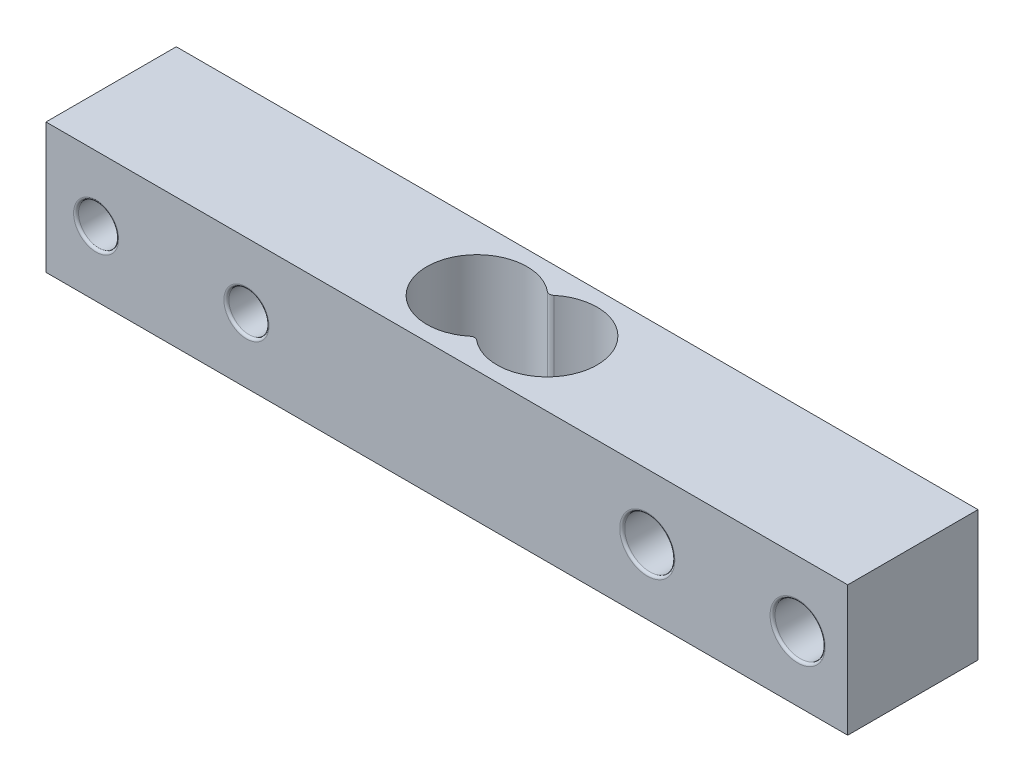
ISO-10303-21;
HEADER;
FILE_DESCRIPTION(('STEP AP214'),'2;1');
FILE_NAME('part.step','',(''),(''),'','','');
FILE_SCHEMA(('AUTOMOTIVE_DESIGN { 1 0 10303 214 1 1 1 1 }'));
ENDSEC;
DATA;
#1=APPLICATION_CONTEXT('core data for automotive mechanical design processes');
#2=APPLICATION_PROTOCOL_DEFINITION('international standard','automotive_design',2000,#1);
#3=PRODUCT_CONTEXT('',#1,'mechanical');
#4=PRODUCT('Part','Part','',(#3));
#5=PRODUCT_RELATED_PRODUCT_CATEGORY('part','',(#4));
#6=PRODUCT_DEFINITION_FORMATION('','',#4);
#7=PRODUCT_DEFINITION_CONTEXT('part definition',#1,'design');
#8=PRODUCT_DEFINITION('design','',#6,#7);
#9=PRODUCT_DEFINITION_SHAPE('','',#8);
#10=(LENGTH_UNIT() NAMED_UNIT(*) SI_UNIT(.MILLI.,.METRE.));
#11=(NAMED_UNIT(*) PLANE_ANGLE_UNIT() SI_UNIT($,.RADIAN.));
#12=(NAMED_UNIT(*) SI_UNIT($,.STERADIAN.) SOLID_ANGLE_UNIT());
#13=UNCERTAINTY_MEASURE_WITH_UNIT(LENGTH_MEASURE(1.E-05),#10,'distance_accuracy_value','');
#14=(GEOMETRIC_REPRESENTATION_CONTEXT(3) GLOBAL_UNCERTAINTY_ASSIGNED_CONTEXT((#13)) GLOBAL_UNIT_ASSIGNED_CONTEXT((#10,
#11,#12)) REPRESENTATION_CONTEXT('',''));
#15=CARTESIAN_POINT('',(0.,0.,0.));
#16=DIRECTION('',(0.,0.,1.));
#17=DIRECTION('',(1.,0.,0.));
#18=AXIS2_PLACEMENT_3D('',#15,#16,#17);
#19=CARTESIAN_POINT('',(52.0209096982276,13.,-13.5538600905865));
#20=DIRECTION('',(1.,0.,0.));
#21=DIRECTION('',(0.,0.,-1.));
#22=AXIS2_PLACEMENT_3D('',#19,#20,#21);
#23=PLANE('',#22);
#24=DIRECTION('',(0.,0.,1.));
#25=VECTOR('',#24,1.);
#26=CARTESIAN_POINT('',(52.0209096982276,0.,-13.5538600905865));
#27=LINE('',#26,#25);
#28=CARTESIAN_POINT('',(52.0209096982276,0.,-13.5538600905865));
#29=VERTEX_POINT('',#28);
#30=CARTESIAN_POINT('',(52.0209096982276,0.,-0.553860090586464));
#31=VERTEX_POINT('',#30);
#32=EDGE_CURVE('E133',#29,#31,#27,.T.);
#33=ORIENTED_EDGE('',*,*,#32,.F.);
#34=DIRECTION('',(0.,-1.,0.));
#35=VECTOR('',#34,1.);
#36=CARTESIAN_POINT('',(52.0209096982276,13.,-13.5538600905865));
#37=LINE('',#36,#35);
#38=CARTESIAN_POINT('',(52.0209096982276,13.,-13.5538600905865));
#39=VERTEX_POINT('',#38);
#40=EDGE_CURVE('E121',#39,#29,#37,.T.);
#41=ORIENTED_EDGE('',*,*,#40,.F.);
#42=DIRECTION('',(0.,0.,1.));
#43=VECTOR('',#42,1.);
#44=CARTESIAN_POINT('',(52.0209096982276,13.,-13.5538600905865));
#45=LINE('',#44,#43);
#46=CARTESIAN_POINT('',(52.0209096982276,13.,-0.553860090586464));
#47=VERTEX_POINT('',#46);
#48=EDGE_CURVE('E116',#39,#47,#45,.T.);
#49=ORIENTED_EDGE('',*,*,#48,.T.);
#50=DIRECTION('',(0.,-1.,0.));
#51=VECTOR('',#50,1.);
#52=CARTESIAN_POINT('',(52.0209096982276,13.,-0.553860090586464));
#53=LINE('',#52,#51);
#54=EDGE_CURVE('E98',#47,#31,#53,.T.);
#55=ORIENTED_EDGE('',*,*,#54,.T.);
#56=EDGE_LOOP('',(#33,#41,#49,#55));
#57=FACE_BOUND('',#56,.T.);
#58=ADVANCED_FACE('F34',(#57),#23,.T.);
#59=CARTESIAN_POINT('',(-27.9790903017724,13.,-13.5538600905865));
#60=DIRECTION('',(0.,0.,-1.));
#61=DIRECTION('',(-1.,0.,0.));
#62=AXIS2_PLACEMENT_3D('',#59,#60,#61);
#63=PLANE('',#62);
#64=CARTESIAN_POINT('',(-7.97909030177238,6.5,-13.5538600905865));
#65=DIRECTION('',(0.,0.,-1.));
#66=DIRECTION('',(-1.,0.,0.));
#67=AXIS2_PLACEMENT_3D('',#64,#65,#66);
#68=CIRCLE('',#67,2.24999999999999);
#69=CARTESIAN_POINT('',(-10.2290903017724,6.5,-13.5538600905865));
#70=VERTEX_POINT('',#69);
#71=EDGE_CURVE('E151',#70,#70,#68,.F.);
#72=ORIENTED_EDGE('',*,*,#71,.T.);
#73=EDGE_LOOP('',(#72));
#74=FACE_BOUND('',#73,.T.);
#75=CARTESIAN_POINT('',(32.0209096982276,6.5,-13.5538600905865));
#76=DIRECTION('',(0.,0.,-1.));
#77=DIRECTION('',(-1.,0.,0.));
#78=AXIS2_PLACEMENT_3D('',#75,#76,#77);
#79=CIRCLE('',#78,2.74999999999999);
#80=CARTESIAN_POINT('',(29.2709096982276,6.5,-13.5538600905865));
#81=VERTEX_POINT('',#80);
#82=EDGE_CURVE('E148',#81,#81,#79,.F.);
#83=ORIENTED_EDGE('',*,*,#82,.T.);
#84=EDGE_LOOP('',(#83));
#85=FACE_BOUND('',#84,.T.);
#86=CARTESIAN_POINT('',(47.0209096982276,6.5,-13.5538600905865));
#87=DIRECTION('',(0.,0.,-1.));
#88=DIRECTION('',(-1.,0.,0.));
#89=AXIS2_PLACEMENT_3D('',#86,#87,#88);
#90=CIRCLE('',#89,2.74999999999999);
#91=CARTESIAN_POINT('',(44.2709096982276,6.5,-13.5538600905865));
#92=VERTEX_POINT('',#91);
#93=EDGE_CURVE('E145',#92,#92,#90,.F.);
#94=ORIENTED_EDGE('',*,*,#93,.T.);
#95=EDGE_LOOP('',(#94));
#96=FACE_BOUND('',#95,.T.);
#97=CARTESIAN_POINT('',(-22.9790903017724,6.5,-13.5538600905865));
#98=DIRECTION('',(0.,0.,-1.));
#99=DIRECTION('',(-1.,0.,0.));
#100=AXIS2_PLACEMENT_3D('',#97,#98,#99);
#101=CIRCLE('',#100,2.24999999999998);
#102=CARTESIAN_POINT('',(-25.2290903017724,6.5,-13.5538600905865));
#103=VERTEX_POINT('',#102);
#104=EDGE_CURVE('E139',#103,#103,#101,.F.);
#105=ORIENTED_EDGE('',*,*,#104,.T.);
#106=EDGE_LOOP('',(#105));
#107=FACE_BOUND('',#106,.T.);
#108=DIRECTION('',(1.,0.,0.));
#109=VECTOR('',#108,1.);
#110=CARTESIAN_POINT('',(-27.9790903017724,0.,-13.5538600905865));
#111=LINE('',#110,#109);
#112=CARTESIAN_POINT('',(-27.9790903017724,0.,-13.5538600905865));
#113=VERTEX_POINT('',#112);
#114=EDGE_CURVE('E122',#113,#29,#111,.T.);
#115=ORIENTED_EDGE('',*,*,#114,.F.);
#116=DIRECTION('',(0.,-1.,0.));
#117=VECTOR('',#116,1.);
#118=CARTESIAN_POINT('',(-27.9790903017724,13.,-13.5538600905865));
#119=LINE('',#118,#117);
#120=CARTESIAN_POINT('',(-27.9790903017724,13.,-13.5538600905865));
#121=VERTEX_POINT('',#120);
#122=EDGE_CURVE('E140',#121,#113,#119,.T.);
#123=ORIENTED_EDGE('',*,*,#122,.F.);
#124=DIRECTION('',(1.,0.,0.));
#125=VECTOR('',#124,1.);
#126=CARTESIAN_POINT('',(-27.9790903017724,13.,-13.5538600905865));
#127=LINE('',#126,#125);
#128=EDGE_CURVE('E109',#121,#39,#127,.T.);
#129=ORIENTED_EDGE('',*,*,#128,.T.);
#130=ORIENTED_EDGE('',*,*,#40,.T.);
#131=EDGE_LOOP('',(#115,#123,#129,#130));
#132=FACE_BOUND('',#131,.T.);
#133=ADVANCED_FACE('F235',(#74,#85,#96,#107,#132),#63,.T.);
#134=CARTESIAN_POINT('',(-27.9790903017724,13.,-0.553860090586464));
#135=DIRECTION('',(-1.,0.,0.));
#136=DIRECTION('',(0.,0.,1.));
#137=AXIS2_PLACEMENT_3D('',#134,#135,#136);
#138=PLANE('',#137);
#139=DIRECTION('',(0.,0.,-1.));
#140=VECTOR('',#139,1.);
#141=CARTESIAN_POINT('',(-27.9790903017724,0.,-0.553860090586464));
#142=LINE('',#141,#140);
#143=CARTESIAN_POINT('',(-27.9790903017724,0.,-0.553860090586464));
#144=VERTEX_POINT('',#143);
#145=EDGE_CURVE('E125',#144,#113,#142,.T.);
#146=ORIENTED_EDGE('',*,*,#145,.F.);
#147=DIRECTION('',(0.,-1.,0.));
#148=VECTOR('',#147,1.);
#149=CARTESIAN_POINT('',(-27.9790903017724,13.,-0.553860090586464));
#150=LINE('',#149,#148);
#151=CARTESIAN_POINT('',(-27.9790903017724,13.,-0.553860090586464));
#152=VERTEX_POINT('',#151);
#153=EDGE_CURVE('E108',#152,#144,#150,.T.);
#154=ORIENTED_EDGE('',*,*,#153,.F.);
#155=DIRECTION('',(0.,0.,-1.));
#156=VECTOR('',#155,1.);
#157=CARTESIAN_POINT('',(-27.9790903017724,13.,-0.553860090586464));
#158=LINE('',#157,#156);
#159=EDGE_CURVE('E119',#152,#121,#158,.T.);
#160=ORIENTED_EDGE('',*,*,#159,.T.);
#161=ORIENTED_EDGE('',*,*,#122,.T.);
#162=EDGE_LOOP('',(#146,#154,#160,#161));
#163=FACE_BOUND('',#162,.T.);
#164=ADVANCED_FACE('F240',(#163),#138,.T.);
#165=CARTESIAN_POINT('',(52.0209096982276,13.,-0.553860090586464));
#166=DIRECTION('',(0.,0.,1.));
#167=DIRECTION('',(1.,0.,0.));
#168=AXIS2_PLACEMENT_3D('',#165,#166,#167);
#169=PLANE('',#168);
#170=CARTESIAN_POINT('',(-7.97909030177238,6.5,-0.553860090586464));
#171=DIRECTION('',(0.,0.,1.));
#172=DIRECTION('',(1.,0.,0.));
#173=AXIS2_PLACEMENT_3D('',#170,#171,#172);
#174=CIRCLE('',#173,2.24999999999999);
#175=CARTESIAN_POINT('',(-5.72909030177239,6.5,-0.553860090586464));
#176=VERTEX_POINT('',#175);
#177=EDGE_CURVE('E169',#176,#176,#174,.F.);
#178=ORIENTED_EDGE('',*,*,#177,.T.);
#179=EDGE_LOOP('',(#178));
#180=FACE_BOUND('',#179,.T.);
#181=CARTESIAN_POINT('',(32.0209096982276,6.5,-0.553860090586464));
#182=DIRECTION('',(0.,0.,1.));
#183=DIRECTION('',(1.,0.,0.));
#184=AXIS2_PLACEMENT_3D('',#181,#182,#183);
#185=CIRCLE('',#184,2.74999999999999);
#186=CARTESIAN_POINT('',(34.7709096982276,6.5,-0.553860090586464));
#187=VERTEX_POINT('',#186);
#188=EDGE_CURVE('E166',#187,#187,#185,.F.);
#189=ORIENTED_EDGE('',*,*,#188,.T.);
#190=EDGE_LOOP('',(#189));
#191=FACE_BOUND('',#190,.T.);
#192=CARTESIAN_POINT('',(-22.9790903017724,6.5,-0.553860090586464));
#193=DIRECTION('',(0.,0.,1.));
#194=DIRECTION('',(1.,0.,0.));
#195=AXIS2_PLACEMENT_3D('',#192,#193,#194);
#196=CIRCLE('',#195,2.24999999999998);
#197=CARTESIAN_POINT('',(-20.7290903017724,6.5,-0.553860090586464));
#198=VERTEX_POINT('',#197);
#199=EDGE_CURVE('E163',#198,#198,#196,.F.);
#200=ORIENTED_EDGE('',*,*,#199,.T.);
#201=EDGE_LOOP('',(#200));
#202=FACE_BOUND('',#201,.T.);
#203=CARTESIAN_POINT('',(47.0209096982276,6.5,-0.553860090586464));
#204=DIRECTION('',(0.,0.,1.));
#205=DIRECTION('',(1.,0.,0.));
#206=AXIS2_PLACEMENT_3D('',#203,#204,#205);
#207=CIRCLE('',#206,2.74999999999999);
#208=CARTESIAN_POINT('',(49.7709096982276,6.5,-0.553860090586464));
#209=VERTEX_POINT('',#208);
#210=EDGE_CURVE('E160',#209,#209,#207,.F.);
#211=ORIENTED_EDGE('',*,*,#210,.T.);
#212=EDGE_LOOP('',(#211));
#213=FACE_BOUND('',#212,.T.);
#214=DIRECTION('',(-1.,0.,0.));
#215=VECTOR('',#214,1.);
#216=CARTESIAN_POINT('',(52.0209096982276,0.,-0.553860090586464));
#217=LINE('',#216,#215);
#218=EDGE_CURVE('E103',#31,#144,#217,.T.);
#219=ORIENTED_EDGE('',*,*,#218,.F.);
#220=ORIENTED_EDGE('',*,*,#54,.F.);
#221=DIRECTION('',(-1.,0.,0.));
#222=VECTOR('',#221,1.);
#223=CARTESIAN_POINT('',(52.0209096982276,13.,-0.553860090586464));
#224=LINE('',#223,#222);
#225=EDGE_CURVE('E101',#47,#152,#224,.T.);
#226=ORIENTED_EDGE('',*,*,#225,.T.);
#227=ORIENTED_EDGE('',*,*,#153,.T.);
#228=EDGE_LOOP('',(#219,#220,#226,#227));
#229=FACE_BOUND('',#228,.T.);
#230=ADVANCED_FACE('F100',(#180,#191,#202,#213,#229),#169,.T.);
#231=CARTESIAN_POINT('',(0.,13.,0.));
#232=DIRECTION('',(0.,-1.,0.));
#233=DIRECTION('',(0.,0.,-1.));
#234=AXIS2_PLACEMENT_3D('',#231,#232,#233);
#235=PLANE('',#234);
#236=CARTESIAN_POINT('',(8.52090969822762,13.,-7.05386009058646));
#237=DIRECTION('',(0.,1.,0.));
#238=DIRECTION('',(0.,0.,1.));
#239=AXIS2_PLACEMENT_3D('',#236,#237,#238);
#240=CIRCLE('',#239,4.99999999999999);
#241=CARTESIAN_POINT('',(11.7027278800458,13.,-10.9108061697858));
#242=VERTEX_POINT('',#241);
#243=CARTESIAN_POINT('',(11.7027278800458,13.,-3.19691401138712));
#244=VERTEX_POINT('',#243);
#245=EDGE_CURVE('E212',#242,#244,#240,.T.);
#246=ORIENTED_EDGE('',*,*,#245,.F.);
#247=CARTESIAN_POINT('',(12.0209096982276,13.,-11.2965007777057));
#248=DIRECTION('',(0.,-1.,0.));
#249=DIRECTION('',(0.,0.,-1.));
#250=AXIS2_PLACEMENT_3D('',#247,#248,#249);
#251=CIRCLE('',#250,0.5);
#252=CARTESIAN_POINT('',(12.3390915164094,13.,-10.9108061697858));
#253=VERTEX_POINT('',#252);
#254=EDGE_CURVE('E198',#242,#253,#251,.F.);
#255=ORIENTED_EDGE('',*,*,#254,.T.);
#256=CARTESIAN_POINT('',(15.5209096982276,13.,-7.05386009058646));
#257=DIRECTION('',(0.,-1.,0.));
#258=DIRECTION('',(0.,0.,-1.));
#259=AXIS2_PLACEMENT_3D('',#256,#257,#258);
#260=CIRCLE('',#259,4.99999999999999);
#261=CARTESIAN_POINT('',(12.3390915164094,13.,-3.19691401138712));
#262=VERTEX_POINT('',#261);
#263=EDGE_CURVE('E205',#253,#262,#260,.T.);
#264=ORIENTED_EDGE('',*,*,#263,.T.);
#265=CARTESIAN_POINT('',(12.0209096982276,13.,-2.81121940346718));
#266=DIRECTION('',(0.,-1.,0.));
#267=DIRECTION('',(0.,0.,-1.));
#268=AXIS2_PLACEMENT_3D('',#265,#266,#267);
#269=CIRCLE('',#268,0.5);
#270=EDGE_CURVE('E196',#262,#244,#269,.F.);
#271=ORIENTED_EDGE('',*,*,#270,.T.);
#272=EDGE_LOOP('',(#246,#255,#264,#271));
#273=FACE_BOUND('',#272,.T.);
#274=ORIENTED_EDGE('',*,*,#48,.F.);
#275=ORIENTED_EDGE('',*,*,#128,.F.);
#276=ORIENTED_EDGE('',*,*,#159,.F.);
#277=ORIENTED_EDGE('',*,*,#225,.F.);
#278=EDGE_LOOP('',(#274,#275,#276,#277));
#279=FACE_BOUND('',#278,.T.);
#280=ADVANCED_FACE('F114',(#273,#279),#235,.F.);
#281=CARTESIAN_POINT('',(0.,0.,0.));
#282=DIRECTION('',(0.,-1.,0.));
#283=DIRECTION('',(0.,0.,-1.));
#284=AXIS2_PLACEMENT_3D('',#281,#282,#283);
#285=PLANE('',#284);
#286=CARTESIAN_POINT('',(15.5209096982276,0.,-7.05386009058646));
#287=DIRECTION('',(0.,-1.,0.));
#288=DIRECTION('',(0.,0.,-1.));
#289=AXIS2_PLACEMENT_3D('',#286,#287,#288);
#290=CIRCLE('',#289,4.99999999999999);
#291=CARTESIAN_POINT('',(12.3390915164094,0.,-10.9108061697858));
#292=VERTEX_POINT('',#291);
#293=CARTESIAN_POINT('',(12.3390915164094,0.,-3.19691401138712));
#294=VERTEX_POINT('',#293);
#295=EDGE_CURVE('E206',#292,#294,#290,.T.);
#296=ORIENTED_EDGE('',*,*,#295,.F.);
#297=CARTESIAN_POINT('',(12.0209096982276,0.,-11.2965007777057));
#298=DIRECTION('',(0.,-1.,0.));
#299=DIRECTION('',(0.,0.,-1.));
#300=AXIS2_PLACEMENT_3D('',#297,#298,#299);
#301=CIRCLE('',#300,0.5);
#302=CARTESIAN_POINT('',(11.7027278800458,0.,-10.9108061697858));
#303=VERTEX_POINT('',#302);
#304=EDGE_CURVE('E11',#292,#303,#301,.T.);
#305=ORIENTED_EDGE('',*,*,#304,.T.);
#306=CARTESIAN_POINT('',(8.52090969822762,0.,-7.05386009058646));
#307=DIRECTION('',(0.,1.,0.));
#308=DIRECTION('',(0.,0.,1.));
#309=AXIS2_PLACEMENT_3D('',#306,#307,#308);
#310=CIRCLE('',#309,4.99999999999999);
#311=CARTESIAN_POINT('',(11.7027278800458,0.,-3.19691401138712));
#312=VERTEX_POINT('',#311);
#313=EDGE_CURVE('E128',#303,#312,#310,.T.);
#314=ORIENTED_EDGE('',*,*,#313,.T.);
#315=CARTESIAN_POINT('',(12.0209096982276,0.,-2.81121940346718));
#316=DIRECTION('',(0.,-1.,0.));
#317=DIRECTION('',(0.,0.,-1.));
#318=AXIS2_PLACEMENT_3D('',#315,#316,#317);
#319=CIRCLE('',#318,0.5);
#320=EDGE_CURVE('E42',#312,#294,#319,.T.);
#321=ORIENTED_EDGE('',*,*,#320,.T.);
#322=EDGE_LOOP('',(#296,#305,#314,#321));
#323=FACE_BOUND('',#322,.T.);
#324=ORIENTED_EDGE('',*,*,#32,.T.);
#325=ORIENTED_EDGE('',*,*,#218,.T.);
#326=ORIENTED_EDGE('',*,*,#145,.T.);
#327=ORIENTED_EDGE('',*,*,#114,.T.);
#328=EDGE_LOOP('',(#324,#325,#326,#327));
#329=FACE_BOUND('',#328,.T.);
#330=ADVANCED_FACE('F219',(#323,#329),#285,.T.);
#331=CARTESIAN_POINT('',(47.0209096982276,6.5,-0.553860090586464));
#332=DIRECTION('',(0.,0.,1.));
#333=DIRECTION('',(1.,0.,0.));
#334=AXIS2_PLACEMENT_3D('',#331,#332,#333);
#335=CYLINDRICAL_SURFACE('',#334,2.49999999999999);
#336=CARTESIAN_POINT('',(47.0209096982276,6.5,-13.3038600905865));
#337=DIRECTION('',(0.,0.,-1.));
#338=DIRECTION('',(-1.,0.,0.));
#339=AXIS2_PLACEMENT_3D('',#336,#337,#338);
#340=CIRCLE('',#339,2.49999999999999);
#341=CARTESIAN_POINT('',(44.5209096982276,6.5,-13.3038600905865));
#342=VERTEX_POINT('',#341);
#343=EDGE_CURVE('E181',#342,#342,#340,.T.);
#344=ORIENTED_EDGE('',*,*,#343,.T.);
#345=EDGE_LOOP('',(#344));
#346=FACE_BOUND('',#345,.T.);
#347=CARTESIAN_POINT('',(47.0209096982276,6.5,-0.803860090586464));
#348=DIRECTION('',(0.,0.,1.));
#349=DIRECTION('',(1.,0.,0.));
#350=AXIS2_PLACEMENT_3D('',#347,#348,#349);
#351=CIRCLE('',#350,2.49999999999999);
#352=CARTESIAN_POINT('',(49.5209096982276,6.5,-0.803860090586464));
#353=VERTEX_POINT('',#352);
#354=EDGE_CURVE('E178',#353,#353,#351,.T.);
#355=ORIENTED_EDGE('',*,*,#354,.T.);
#356=EDGE_LOOP('',(#355));
#357=FACE_BOUND('',#356,.T.);
#358=ADVANCED_FACE('F278',(#346,#357),#335,.F.);
#359=CARTESIAN_POINT('',(32.0209096982276,6.5,-0.553860090586464));
#360=DIRECTION('',(0.,0.,1.));
#361=DIRECTION('',(1.,0.,0.));
#362=AXIS2_PLACEMENT_3D('',#359,#360,#361);
#363=CYLINDRICAL_SURFACE('',#362,2.49999999999999);
#364=CARTESIAN_POINT('',(32.0209096982276,6.5,-13.3038600905865));
#365=DIRECTION('',(0.,0.,-1.));
#366=DIRECTION('',(-1.,0.,0.));
#367=AXIS2_PLACEMENT_3D('',#364,#365,#366);
#368=CIRCLE('',#367,2.49999999999999);
#369=CARTESIAN_POINT('',(29.5209096982276,6.5,-13.3038600905865));
#370=VERTEX_POINT('',#369);
#371=EDGE_CURVE('E175',#370,#370,#368,.T.);
#372=ORIENTED_EDGE('',*,*,#371,.T.);
#373=EDGE_LOOP('',(#372));
#374=FACE_BOUND('',#373,.T.);
#375=CARTESIAN_POINT('',(32.0209096982276,6.5,-0.803860090586464));
#376=DIRECTION('',(0.,0.,1.));
#377=DIRECTION('',(1.,0.,0.));
#378=AXIS2_PLACEMENT_3D('',#375,#376,#377);
#379=CIRCLE('',#378,2.49999999999999);
#380=CARTESIAN_POINT('',(34.5209096982276,6.5,-0.803860090586464));
#381=VERTEX_POINT('',#380);
#382=EDGE_CURVE('E172',#381,#381,#379,.T.);
#383=ORIENTED_EDGE('',*,*,#382,.T.);
#384=EDGE_LOOP('',(#383));
#385=FACE_BOUND('',#384,.T.);
#386=ADVANCED_FACE('F280',(#374,#385),#363,.F.);
#387=CARTESIAN_POINT('',(-7.97909030177238,6.5,-0.553860090586464));
#388=DIRECTION('',(0.,0.,1.));
#389=DIRECTION('',(1.,0.,0.));
#390=AXIS2_PLACEMENT_3D('',#387,#388,#389);
#391=CYLINDRICAL_SURFACE('',#390,1.99999999999999);
#392=CARTESIAN_POINT('',(-7.97909030177238,6.5,-13.3038600905865));
#393=DIRECTION('',(0.,0.,-1.));
#394=DIRECTION('',(-1.,0.,0.));
#395=AXIS2_PLACEMENT_3D('',#392,#393,#394);
#396=CIRCLE('',#395,1.99999999999999);
#397=CARTESIAN_POINT('',(-9.97909030177237,6.5,-13.3038600905865));
#398=VERTEX_POINT('',#397);
#399=EDGE_CURVE('E157',#398,#398,#396,.T.);
#400=ORIENTED_EDGE('',*,*,#399,.T.);
#401=EDGE_LOOP('',(#400));
#402=FACE_BOUND('',#401,.T.);
#403=CARTESIAN_POINT('',(-7.97909030177238,6.5,-0.803860090586464));
#404=DIRECTION('',(0.,0.,1.));
#405=DIRECTION('',(1.,0.,0.));
#406=AXIS2_PLACEMENT_3D('',#403,#404,#405);
#407=CIRCLE('',#406,1.99999999999999);
#408=CARTESIAN_POINT('',(-5.97909030177239,6.5,-0.803860090586464));
#409=VERTEX_POINT('',#408);
#410=EDGE_CURVE('E154',#409,#409,#407,.T.);
#411=ORIENTED_EDGE('',*,*,#410,.T.);
#412=EDGE_LOOP('',(#411));
#413=FACE_BOUND('',#412,.T.);
#414=ADVANCED_FACE('F287',(#402,#413),#391,.F.);
#415=CARTESIAN_POINT('',(-22.9790903017724,6.5,-13.5538600905865));
#416=DIRECTION('',(0.,0.,-1.));
#417=DIRECTION('',(-1.,0.,0.));
#418=AXIS2_PLACEMENT_3D('',#415,#416,#417);
#419=CYLINDRICAL_SURFACE('',#418,1.99999999999998);
#420=CARTESIAN_POINT('',(-22.9790903017724,6.5,-0.803860090586464));
#421=DIRECTION('',(0.,0.,1.));
#422=DIRECTION('',(1.,0.,0.));
#423=AXIS2_PLACEMENT_3D('',#420,#421,#422);
#424=CIRCLE('',#423,1.99999999999998);
#425=CARTESIAN_POINT('',(-20.9790903017724,6.5,-0.803860090586464));
#426=VERTEX_POINT('',#425);
#427=EDGE_CURVE('E187',#426,#426,#424,.T.);
#428=ORIENTED_EDGE('',*,*,#427,.T.);
#429=EDGE_LOOP('',(#428));
#430=FACE_BOUND('',#429,.T.);
#431=CARTESIAN_POINT('',(-22.9790903017724,6.5,-13.3038600905865));
#432=DIRECTION('',(0.,0.,-1.));
#433=DIRECTION('',(-1.,0.,0.));
#434=AXIS2_PLACEMENT_3D('',#431,#432,#433);
#435=CIRCLE('',#434,1.99999999999998);
#436=CARTESIAN_POINT('',(-24.9790903017724,6.5,-13.3038600905865));
#437=VERTEX_POINT('',#436);
#438=EDGE_CURVE('E184',#437,#437,#435,.T.);
#439=ORIENTED_EDGE('',*,*,#438,.T.);
#440=EDGE_LOOP('',(#439));
#441=FACE_BOUND('',#440,.T.);
#442=ADVANCED_FACE('F319',(#430,#441),#419,.F.);
#443=CARTESIAN_POINT('',(8.52090969822762,13.,-7.05386009058646));
#444=DIRECTION('',(0.,1.,0.));
#445=DIRECTION('',(0.,0.,1.));
#446=AXIS2_PLACEMENT_3D('',#443,#444,#445);
#447=CYLINDRICAL_SURFACE('',#446,4.99999999999999);
#448=ORIENTED_EDGE('',*,*,#313,.F.);
#449=DIRECTION('',(0.,1.,0.));
#450=VECTOR('',#449,1.);
#451=CARTESIAN_POINT('',(11.7027278800458,13.,-10.9108061697858));
#452=LINE('',#451,#450);
#453=EDGE_CURVE('E193',#303,#242,#452,.T.);
#454=ORIENTED_EDGE('',*,*,#453,.T.);
#455=ORIENTED_EDGE('',*,*,#245,.T.);
#456=DIRECTION('',(0.,1.,0.));
#457=VECTOR('',#456,1.);
#458=CARTESIAN_POINT('',(11.7027278800458,13.,-3.19691401138712));
#459=LINE('',#458,#457);
#460=EDGE_CURVE('E190',#244,#312,#459,.F.);
#461=ORIENTED_EDGE('',*,*,#460,.T.);
#462=EDGE_LOOP('',(#448,#454,#455,#461));
#463=FACE_BOUND('',#462,.T.);
#464=ADVANCED_FACE('F217',(#463),#447,.F.);
#465=CARTESIAN_POINT('',(15.5209096982276,0.,-7.05386009058646));
#466=DIRECTION('',(0.,-1.,0.));
#467=DIRECTION('',(0.,0.,-1.));
#468=AXIS2_PLACEMENT_3D('',#465,#466,#467);
#469=CYLINDRICAL_SURFACE('',#468,4.99999999999999);
#470=ORIENTED_EDGE('',*,*,#263,.F.);
#471=DIRECTION('',(0.,-1.,0.));
#472=VECTOR('',#471,1.);
#473=CARTESIAN_POINT('',(12.3390915164094,0.,-10.9108061697858));
#474=LINE('',#473,#472);
#475=EDGE_CURVE('E55',#253,#292,#474,.T.);
#476=ORIENTED_EDGE('',*,*,#475,.T.);
#477=ORIENTED_EDGE('',*,*,#295,.T.);
#478=DIRECTION('',(0.,-1.,0.));
#479=VECTOR('',#478,1.);
#480=CARTESIAN_POINT('',(12.3390915164094,0.,-3.19691401138712));
#481=LINE('',#480,#479);
#482=EDGE_CURVE('E200',#294,#262,#481,.F.);
#483=ORIENTED_EDGE('',*,*,#482,.T.);
#484=EDGE_LOOP('',(#470,#476,#477,#483));
#485=FACE_BOUND('',#484,.T.);
#486=ADVANCED_FACE('F204',(#485),#469,.F.);
#487=CARTESIAN_POINT('',(-7.97909030177238,6.5,-13.3038600905865));
#488=DIRECTION('',(0.,0.,-1.));
#489=DIRECTION('',(-1.,0.,0.));
#490=AXIS2_PLACEMENT_3D('',#487,#488,#489);
#491=TOROIDAL_SURFACE('',#490,2.24999999999999,0.25);
#492=ORIENTED_EDGE('',*,*,#399,.F.);
#493=EDGE_LOOP('',(#492));
#494=FACE_BOUND('',#493,.T.);
#495=ORIENTED_EDGE('',*,*,#71,.F.);
#496=EDGE_LOOP('',(#495));
#497=FACE_BOUND('',#496,.T.);
#498=ADVANCED_FACE('F246',(#494,#497),#491,.T.);
#499=CARTESIAN_POINT('',(-7.97909030177238,6.5,-0.803860090586464));
#500=DIRECTION('',(0.,0.,1.));
#501=DIRECTION('',(1.,0.,0.));
#502=AXIS2_PLACEMENT_3D('',#499,#500,#501);
#503=TOROIDAL_SURFACE('',#502,2.24999999999999,0.25);
#504=ORIENTED_EDGE('',*,*,#177,.F.);
#505=EDGE_LOOP('',(#504));
#506=FACE_BOUND('',#505,.T.);
#507=ORIENTED_EDGE('',*,*,#410,.F.);
#508=EDGE_LOOP('',(#507));
#509=FACE_BOUND('',#508,.T.);
#510=ADVANCED_FACE('F249',(#506,#509),#503,.T.);
#511=CARTESIAN_POINT('',(32.0209096982276,6.5,-13.3038600905865));
#512=DIRECTION('',(0.,0.,-1.));
#513=DIRECTION('',(-1.,0.,0.));
#514=AXIS2_PLACEMENT_3D('',#511,#512,#513);
#515=TOROIDAL_SURFACE('',#514,2.74999999999999,0.25);
#516=ORIENTED_EDGE('',*,*,#371,.F.);
#517=EDGE_LOOP('',(#516));
#518=FACE_BOUND('',#517,.T.);
#519=ORIENTED_EDGE('',*,*,#82,.F.);
#520=EDGE_LOOP('',(#519));
#521=FACE_BOUND('',#520,.T.);
#522=ADVANCED_FACE('F253',(#518,#521),#515,.T.);
#523=CARTESIAN_POINT('',(47.0209096982276,6.5,-13.3038600905865));
#524=DIRECTION('',(0.,0.,-1.));
#525=DIRECTION('',(-1.,0.,0.));
#526=AXIS2_PLACEMENT_3D('',#523,#524,#525);
#527=TOROIDAL_SURFACE('',#526,2.74999999999999,0.25);
#528=ORIENTED_EDGE('',*,*,#343,.F.);
#529=EDGE_LOOP('',(#528));
#530=FACE_BOUND('',#529,.T.);
#531=ORIENTED_EDGE('',*,*,#93,.F.);
#532=EDGE_LOOP('',(#531));
#533=FACE_BOUND('',#532,.T.);
#534=ADVANCED_FACE('F257',(#530,#533),#527,.T.);
#535=CARTESIAN_POINT('',(32.0209096982276,6.5,-0.803860090586464));
#536=DIRECTION('',(0.,0.,1.));
#537=DIRECTION('',(1.,0.,0.));
#538=AXIS2_PLACEMENT_3D('',#535,#536,#537);
#539=TOROIDAL_SURFACE('',#538,2.74999999999999,0.25);
#540=ORIENTED_EDGE('',*,*,#188,.F.);
#541=EDGE_LOOP('',(#540));
#542=FACE_BOUND('',#541,.T.);
#543=ORIENTED_EDGE('',*,*,#382,.F.);
#544=EDGE_LOOP('',(#543));
#545=FACE_BOUND('',#544,.T.);
#546=ADVANCED_FACE('F261',(#542,#545),#539,.T.);
#547=CARTESIAN_POINT('',(-22.9790903017724,6.5,-0.803860090586464));
#548=DIRECTION('',(0.,0.,1.));
#549=DIRECTION('',(1.,0.,0.));
#550=AXIS2_PLACEMENT_3D('',#547,#548,#549);
#551=TOROIDAL_SURFACE('',#550,2.24999999999998,0.25);
#552=ORIENTED_EDGE('',*,*,#427,.F.);
#553=EDGE_LOOP('',(#552));
#554=FACE_BOUND('',#553,.T.);
#555=ORIENTED_EDGE('',*,*,#199,.F.);
#556=EDGE_LOOP('',(#555));
#557=FACE_BOUND('',#556,.T.);
#558=ADVANCED_FACE('F265',(#554,#557),#551,.T.);
#559=CARTESIAN_POINT('',(47.0209096982276,6.5,-0.803860090586464));
#560=DIRECTION('',(0.,0.,1.));
#561=DIRECTION('',(1.,0.,0.));
#562=AXIS2_PLACEMENT_3D('',#559,#560,#561);
#563=TOROIDAL_SURFACE('',#562,2.74999999999999,0.25);
#564=ORIENTED_EDGE('',*,*,#210,.F.);
#565=EDGE_LOOP('',(#564));
#566=FACE_BOUND('',#565,.T.);
#567=ORIENTED_EDGE('',*,*,#354,.F.);
#568=EDGE_LOOP('',(#567));
#569=FACE_BOUND('',#568,.T.);
#570=ADVANCED_FACE('F231',(#566,#569),#563,.T.);
#571=CARTESIAN_POINT('',(-22.9790903017724,6.5,-13.3038600905865));
#572=DIRECTION('',(0.,0.,-1.));
#573=DIRECTION('',(-1.,0.,0.));
#574=AXIS2_PLACEMENT_3D('',#571,#572,#573);
#575=TOROIDAL_SURFACE('',#574,2.24999999999998,0.25);
#576=ORIENTED_EDGE('',*,*,#104,.F.);
#577=EDGE_LOOP('',(#576));
#578=FACE_BOUND('',#577,.T.);
#579=ORIENTED_EDGE('',*,*,#438,.F.);
#580=EDGE_LOOP('',(#579));
#581=FACE_BOUND('',#580,.T.);
#582=ADVANCED_FACE('F226',(#578,#581),#575,.T.);
#583=CARTESIAN_POINT('',(12.0209096982276,0.,-11.2965007777057));
#584=DIRECTION('',(0.,1.,0.));
#585=DIRECTION('',(0.,0.,1.));
#586=AXIS2_PLACEMENT_3D('',#583,#584,#585);
#587=CYLINDRICAL_SURFACE('',#586,0.5);
#588=ORIENTED_EDGE('',*,*,#304,.F.);
#589=ORIENTED_EDGE('',*,*,#475,.F.);
#590=ORIENTED_EDGE('',*,*,#254,.F.);
#591=ORIENTED_EDGE('',*,*,#453,.F.);
#592=EDGE_LOOP('',(#588,#589,#590,#591));
#593=FACE_BOUND('',#592,.T.);
#594=ADVANCED_FACE('F224',(#593),#587,.T.);
#595=CARTESIAN_POINT('',(12.0209096982276,0.,-2.81121940346718));
#596=DIRECTION('',(0.,-1.,0.));
#597=DIRECTION('',(0.,0.,-1.));
#598=AXIS2_PLACEMENT_3D('',#595,#596,#597);
#599=CYLINDRICAL_SURFACE('',#598,0.5);
#600=ORIENTED_EDGE('',*,*,#270,.F.);
#601=ORIENTED_EDGE('',*,*,#482,.F.);
#602=ORIENTED_EDGE('',*,*,#320,.F.);
#603=ORIENTED_EDGE('',*,*,#460,.F.);
#604=EDGE_LOOP('',(#600,#601,#602,#603));
#605=FACE_BOUND('',#604,.T.);
#606=ADVANCED_FACE('F36',(#605),#599,.T.);
#607=CLOSED_SHELL('',(#58,#133,#164,#230,#280,#330,#358,#386,#414,#442,#464,#486,#498,#510,#522,
#534,#546,#558,#570,#582,#594,#606));
#608=MANIFOLD_SOLID_BREP('B2',#607);
#609=ADVANCED_BREP_SHAPE_REPRESENTATION('',(#18,#608),#14);
#610=SHAPE_DEFINITION_REPRESENTATION(#9,#609);
ENDSEC;
END-ISO-10303-21;
